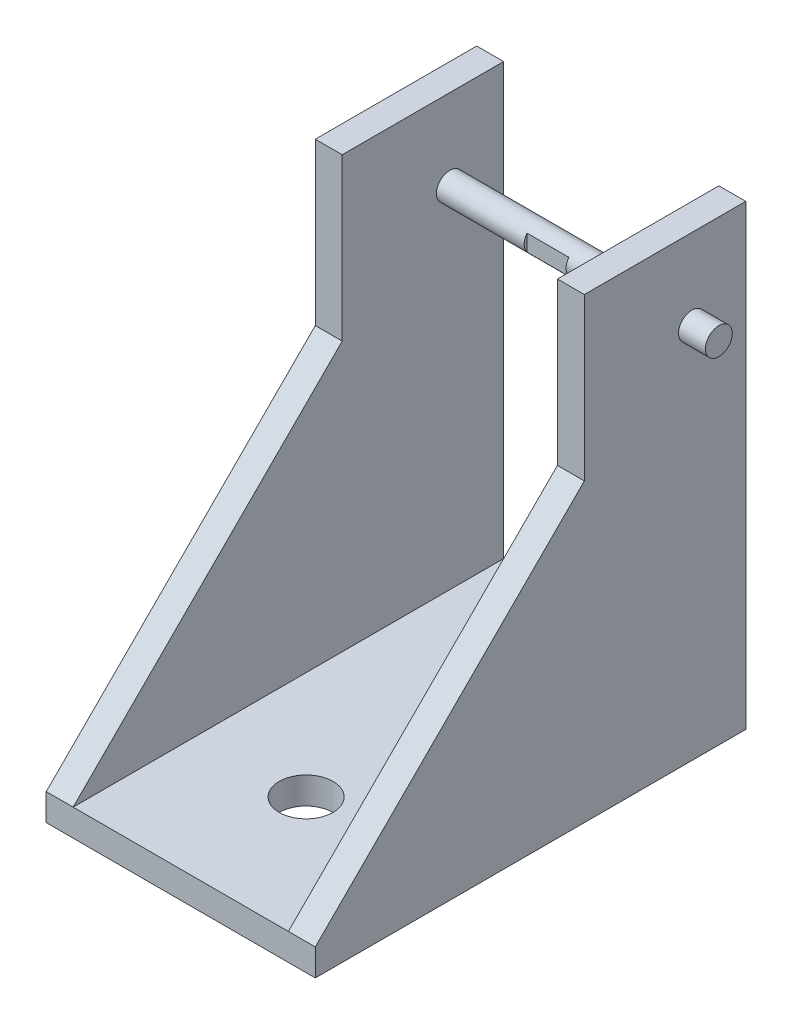
ISO-10303-21;
HEADER;
FILE_DESCRIPTION(('STEP AP214'),'2;1');
FILE_NAME('part.step','',(''),(''),'','','');
FILE_SCHEMA(('AUTOMOTIVE_DESIGN { 1 0 10303 214 1 1 1 1 }'));
ENDSEC;
DATA;
#1=APPLICATION_CONTEXT('core data for automotive mechanical design processes');
#2=APPLICATION_PROTOCOL_DEFINITION('international standard','automotive_design',2000,#1);
#3=PRODUCT_CONTEXT('',#1,'mechanical');
#4=PRODUCT('Part','Part','',(#3));
#5=PRODUCT_RELATED_PRODUCT_CATEGORY('part','',(#4));
#6=PRODUCT_DEFINITION_FORMATION('','',#4);
#7=PRODUCT_DEFINITION_CONTEXT('part definition',#1,'design');
#8=PRODUCT_DEFINITION('design','',#6,#7);
#9=PRODUCT_DEFINITION_SHAPE('','',#8);
#10=(LENGTH_UNIT() NAMED_UNIT(*) SI_UNIT(.MILLI.,.METRE.));
#11=(NAMED_UNIT(*) PLANE_ANGLE_UNIT() SI_UNIT($,.RADIAN.));
#12=(NAMED_UNIT(*) SI_UNIT($,.STERADIAN.) SOLID_ANGLE_UNIT());
#13=UNCERTAINTY_MEASURE_WITH_UNIT(LENGTH_MEASURE(1.E-05),#10,'distance_accuracy_value','');
#14=(GEOMETRIC_REPRESENTATION_CONTEXT(3) GLOBAL_UNCERTAINTY_ASSIGNED_CONTEXT((#13)) GLOBAL_UNIT_ASSIGNED_CONTEXT((#10,
#11,#12)) REPRESENTATION_CONTEXT('',''));
#15=CARTESIAN_POINT('',(0.,0.,0.));
#16=DIRECTION('',(0.,0.,1.));
#17=DIRECTION('',(1.,0.,0.));
#18=AXIS2_PLACEMENT_3D('',#15,#16,#17);
#19=CARTESIAN_POINT('',(0.,6.35,101.6));
#20=DIRECTION('',(0.,-1.,0.));
#21=DIRECTION('',(0.,0.,-1.));
#22=AXIS2_PLACEMENT_3D('',#19,#20,#21);
#23=PLANE('',#22);
#24=CARTESIAN_POINT('',(31.75,6.35,32.1144770075607));
#25=DIRECTION('',(0.,1.,0.));
#26=DIRECTION('',(0.,0.,1.));
#27=AXIS2_PLACEMENT_3D('',#24,#25,#26);
#28=CIRCLE('',#27,6.35);
#29=CARTESIAN_POINT('',(31.75,6.35,38.4644770075607));
#30=VERTEX_POINT('',#29);
#31=EDGE_CURVE('E292',#30,#30,#28,.T.);
#32=ORIENTED_EDGE('',*,*,#31,.F.);
#33=EDGE_LOOP('',(#32));
#34=FACE_BOUND('',#33,.T.);
#35=CARTESIAN_POINT('',(31.75,6.35,72.0235509811005));
#36=DIRECTION('',(0.,1.,0.));
#37=DIRECTION('',(0.,0.,1.));
#38=AXIS2_PLACEMENT_3D('',#35,#36,#37);
#39=CIRCLE('',#38,6.35);
#40=CARTESIAN_POINT('',(31.75,6.35,78.3735509811005));
#41=VERTEX_POINT('',#40);
#42=EDGE_CURVE('E286',#41,#41,#39,.T.);
#43=ORIENTED_EDGE('',*,*,#42,.F.);
#44=EDGE_LOOP('',(#43));
#45=FACE_BOUND('',#44,.T.);
#46=DIRECTION('',(0.,0.,-1.));
#47=VECTOR('',#46,1.);
#48=CARTESIAN_POINT('',(6.35,6.35,0.));
#49=LINE('',#48,#47);
#50=CARTESIAN_POINT('',(6.35,6.35,101.6));
#51=VERTEX_POINT('',#50);
#52=CARTESIAN_POINT('',(6.35,6.35,0.));
#53=VERTEX_POINT('',#52);
#54=EDGE_CURVE('E61',#51,#53,#49,.T.);
#55=ORIENTED_EDGE('',*,*,#54,.F.);
#56=DIRECTION('',(-1.,0.,0.));
#57=VECTOR('',#56,1.);
#58=CARTESIAN_POINT('',(0.,6.35,101.6));
#59=LINE('',#58,#57);
#60=CARTESIAN_POINT('',(57.15,6.35,101.6));
#61=VERTEX_POINT('',#60);
#62=EDGE_CURVE('E196',#61,#51,#59,.T.);
#63=ORIENTED_EDGE('',*,*,#62,.F.);
#64=DIRECTION('',(0.,0.,-1.));
#65=VECTOR('',#64,1.);
#66=CARTESIAN_POINT('',(57.15,6.35,0.));
#67=LINE('',#66,#65);
#68=CARTESIAN_POINT('',(57.15,6.35,0.));
#69=VERTEX_POINT('',#68);
#70=EDGE_CURVE('E156',#61,#69,#67,.T.);
#71=ORIENTED_EDGE('',*,*,#70,.T.);
#72=DIRECTION('',(-1.,0.,0.));
#73=VECTOR('',#72,1.);
#74=CARTESIAN_POINT('',(0.,6.35,0.));
#75=LINE('',#74,#73);
#76=EDGE_CURVE('E191',#69,#53,#75,.T.);
#77=ORIENTED_EDGE('',*,*,#76,.T.);
#78=EDGE_LOOP('',(#55,#63,#71,#77));
#79=FACE_BOUND('',#78,.T.);
#80=ADVANCED_FACE('F39',(#34,#45,#79),#23,.F.);
#81=CARTESIAN_POINT('',(0.,0.,101.6));
#82=DIRECTION('',(1.,0.,0.));
#83=DIRECTION('',(0.,0.,-1.));
#84=AXIS2_PLACEMENT_3D('',#81,#82,#83);
#85=PLANE('',#84);
#86=CARTESIAN_POINT('',(0.,88.9,12.7));
#87=DIRECTION('',(1.,0.,0.));
#88=DIRECTION('',(0.,0.,-1.));
#89=AXIS2_PLACEMENT_3D('',#86,#87,#88);
#90=CIRCLE('',#89,3.175);
#91=CARTESIAN_POINT('',(0.,88.9,9.525));
#92=VERTEX_POINT('',#91);
#93=EDGE_CURVE('E257',#92,#92,#90,.T.);
#94=ORIENTED_EDGE('',*,*,#93,.T.);
#95=EDGE_LOOP('',(#94));
#96=FACE_BOUND('',#95,.T.);
#97=DIRECTION('',(0.,-1.,0.));
#98=VECTOR('',#97,1.);
#99=CARTESIAN_POINT('',(0.,0.,0.));
#100=LINE('',#99,#98);
#101=CARTESIAN_POINT('',(0.,107.95,0.));
#102=VERTEX_POINT('',#101);
#103=CARTESIAN_POINT('',(0.,0.,0.));
#104=VERTEX_POINT('',#103);
#105=EDGE_CURVE('E182',#102,#104,#100,.T.);
#106=ORIENTED_EDGE('',*,*,#105,.T.);
#107=DIRECTION('',(0.,0.,-1.));
#108=VECTOR('',#107,1.);
#109=CARTESIAN_POINT('',(0.,0.,101.6));
#110=LINE('',#109,#108);
#111=CARTESIAN_POINT('',(0.,0.,101.6));
#112=VERTEX_POINT('',#111);
#113=EDGE_CURVE('E138',#112,#104,#110,.T.);
#114=ORIENTED_EDGE('',*,*,#113,.F.);
#115=DIRECTION('',(0.,-1.,0.));
#116=VECTOR('',#115,1.);
#117=CARTESIAN_POINT('',(0.,0.,101.6));
#118=LINE('',#117,#116);
#119=CARTESIAN_POINT('',(0.,6.35,101.6));
#120=VERTEX_POINT('',#119);
#121=EDGE_CURVE('E187',#120,#112,#118,.T.);
#122=ORIENTED_EDGE('',*,*,#121,.F.);
#123=DIRECTION('',(0.,-0.70710678118655,0.707106781186545));
#124=VECTOR('',#123,1.);
#125=CARTESIAN_POINT('',(0.,6.35,101.6));
#126=LINE('',#125,#124);
#127=CARTESIAN_POINT('',(0.,69.8500000000006,38.0999999999998));
#128=VERTEX_POINT('',#127);
#129=EDGE_CURVE('E251',#128,#120,#126,.T.);
#130=ORIENTED_EDGE('',*,*,#129,.F.);
#131=DIRECTION('',(0.,-1.,0.));
#132=VECTOR('',#131,1.);
#133=CARTESIAN_POINT('',(0.,107.95,38.0999999999993));
#134=LINE('',#133,#132);
#135=CARTESIAN_POINT('',(0.,107.95,38.0999999999993));
#136=VERTEX_POINT('',#135);
#137=EDGE_CURVE('E248',#136,#128,#134,.T.);
#138=ORIENTED_EDGE('',*,*,#137,.F.);
#139=DIRECTION('',(0.,0.,1.));
#140=VECTOR('',#139,1.);
#141=CARTESIAN_POINT('',(0.,107.95,0.));
#142=LINE('',#141,#140);
#143=EDGE_CURVE('E254',#102,#136,#142,.T.);
#144=ORIENTED_EDGE('',*,*,#143,.F.);
#145=EDGE_LOOP('',(#106,#114,#122,#130,#138,#144));
#146=FACE_BOUND('',#145,.T.);
#147=ADVANCED_FACE('F41',(#96,#146),#85,.F.);
#148=CARTESIAN_POINT('',(0.,0.,101.6));
#149=DIRECTION('',(0.,1.,0.));
#150=DIRECTION('',(0.,0.,1.));
#151=AXIS2_PLACEMENT_3D('',#148,#149,#150);
#152=PLANE('',#151);
#153=CARTESIAN_POINT('',(31.75,0.,32.1144770075607));
#154=DIRECTION('',(0.,1.,0.));
#155=DIRECTION('',(0.,0.,1.));
#156=AXIS2_PLACEMENT_3D('',#153,#154,#155);
#157=CIRCLE('',#156,6.35);
#158=CARTESIAN_POINT('',(31.75,0.,38.4644770075607));
#159=VERTEX_POINT('',#158);
#160=EDGE_CURVE('E289',#159,#159,#157,.F.);
#161=ORIENTED_EDGE('',*,*,#160,.F.);
#162=EDGE_LOOP('',(#161));
#163=FACE_BOUND('',#162,.T.);
#164=CARTESIAN_POINT('',(31.75,0.,72.0235509811005));
#165=DIRECTION('',(0.,1.,0.));
#166=DIRECTION('',(0.,0.,1.));
#167=AXIS2_PLACEMENT_3D('',#164,#165,#166);
#168=CIRCLE('',#167,6.35);
#169=CARTESIAN_POINT('',(31.75,0.,78.3735509811005));
#170=VERTEX_POINT('',#169);
#171=EDGE_CURVE('E283',#170,#170,#168,.F.);
#172=ORIENTED_EDGE('',*,*,#171,.F.);
#173=EDGE_LOOP('',(#172));
#174=FACE_BOUND('',#173,.T.);
#175=DIRECTION('',(1.,0.,0.));
#176=VECTOR('',#175,1.);
#177=CARTESIAN_POINT('',(0.,0.,0.));
#178=LINE('',#177,#176);
#179=CARTESIAN_POINT('',(63.5,0.,0.));
#180=VERTEX_POINT('',#179);
#181=EDGE_CURVE('E334',#104,#180,#178,.T.);
#182=ORIENTED_EDGE('',*,*,#181,.T.);
#183=DIRECTION('',(0.,0.,-1.));
#184=VECTOR('',#183,1.);
#185=CARTESIAN_POINT('',(63.5,0.,101.6));
#186=LINE('',#185,#184);
#187=CARTESIAN_POINT('',(63.5,0.,101.6));
#188=VERTEX_POINT('',#187);
#189=EDGE_CURVE('E206',#188,#180,#186,.T.);
#190=ORIENTED_EDGE('',*,*,#189,.F.);
#191=DIRECTION('',(1.,0.,0.));
#192=VECTOR('',#191,1.);
#193=CARTESIAN_POINT('',(0.,0.,101.6));
#194=LINE('',#193,#192);
#195=EDGE_CURVE('E190',#112,#188,#194,.T.);
#196=ORIENTED_EDGE('',*,*,#195,.F.);
#197=ORIENTED_EDGE('',*,*,#113,.T.);
#198=EDGE_LOOP('',(#182,#190,#196,#197));
#199=FACE_BOUND('',#198,.T.);
#200=ADVANCED_FACE('F315',(#163,#174,#199),#152,.F.);
#201=CARTESIAN_POINT('',(63.5,0.,101.6));
#202=DIRECTION('',(-1.,0.,0.));
#203=DIRECTION('',(0.,0.,1.));
#204=AXIS2_PLACEMENT_3D('',#201,#202,#203);
#205=PLANE('',#204);
#206=CARTESIAN_POINT('',(63.5,88.9,12.7));
#207=DIRECTION('',(-1.,0.,0.));
#208=DIRECTION('',(0.,0.,1.));
#209=AXIS2_PLACEMENT_3D('',#206,#207,#208);
#210=CIRCLE('',#209,3.175);
#211=CARTESIAN_POINT('',(63.5,88.9,15.875));
#212=VERTEX_POINT('',#211);
#213=EDGE_CURVE('E268',#212,#212,#210,.T.);
#214=ORIENTED_EDGE('',*,*,#213,.T.);
#215=EDGE_LOOP('',(#214));
#216=FACE_BOUND('',#215,.T.);
#217=DIRECTION('',(0.,1.,0.));
#218=VECTOR('',#217,1.);
#219=CARTESIAN_POINT('',(63.5,0.,0.));
#220=LINE('',#219,#218);
#221=CARTESIAN_POINT('',(63.5,107.95,0.));
#222=VERTEX_POINT('',#221);
#223=EDGE_CURVE('E337',#180,#222,#220,.T.);
#224=ORIENTED_EDGE('',*,*,#223,.T.);
#225=DIRECTION('',(0.,0.,1.));
#226=VECTOR('',#225,1.);
#227=CARTESIAN_POINT('',(63.5,107.95,0.));
#228=LINE('',#227,#226);
#229=CARTESIAN_POINT('',(63.5,107.95,38.0999999999993));
#230=VERTEX_POINT('',#229);
#231=EDGE_CURVE('E168',#222,#230,#228,.T.);
#232=ORIENTED_EDGE('',*,*,#231,.T.);
#233=DIRECTION('',(0.,-1.,0.));
#234=VECTOR('',#233,1.);
#235=CARTESIAN_POINT('',(63.5,107.95,38.0999999999993));
#236=LINE('',#235,#234);
#237=CARTESIAN_POINT('',(63.5,69.8500000000006,38.0999999999998));
#238=VERTEX_POINT('',#237);
#239=EDGE_CURVE('E171',#230,#238,#236,.T.);
#240=ORIENTED_EDGE('',*,*,#239,.T.);
#241=DIRECTION('',(0.,-0.70710678118655,0.707106781186545));
#242=VECTOR('',#241,1.);
#243=CARTESIAN_POINT('',(63.5,6.35,101.6));
#244=LINE('',#243,#242);
#245=CARTESIAN_POINT('',(63.5,6.35,101.6));
#246=VERTEX_POINT('',#245);
#247=EDGE_CURVE('E175',#238,#246,#244,.T.);
#248=ORIENTED_EDGE('',*,*,#247,.T.);
#249=DIRECTION('',(0.,1.,0.));
#250=VECTOR('',#249,1.);
#251=CARTESIAN_POINT('',(63.5,0.,101.6));
#252=LINE('',#251,#250);
#253=EDGE_CURVE('E193',#188,#246,#252,.T.);
#254=ORIENTED_EDGE('',*,*,#253,.F.);
#255=ORIENTED_EDGE('',*,*,#189,.T.);
#256=EDGE_LOOP('',(#224,#232,#240,#248,#254,#255));
#257=FACE_BOUND('',#256,.T.);
#258=ADVANCED_FACE('F228',(#216,#257),#205,.F.);
#259=CARTESIAN_POINT('',(0.,6.35,101.6));
#260=DIRECTION('',(0.,0.,-1.));
#261=DIRECTION('',(-1.,0.,0.));
#262=AXIS2_PLACEMENT_3D('',#259,#260,#261);
#263=PLANE('',#262);
#264=ORIENTED_EDGE('',*,*,#121,.T.);
#265=ORIENTED_EDGE('',*,*,#195,.T.);
#266=ORIENTED_EDGE('',*,*,#253,.T.);
#267=EDGE_CURVE('E204',#246,#61,#59,.T.);
#268=ORIENTED_EDGE('',*,*,#267,.T.);
#269=ORIENTED_EDGE('',*,*,#62,.T.);
#270=DIRECTION('',(-1.,0.,0.));
#271=VECTOR('',#270,1.);
#272=CARTESIAN_POINT('',(6.35,6.35,101.6));
#273=LINE('',#272,#271);
#274=EDGE_CURVE('E240',#51,#120,#273,.T.);
#275=ORIENTED_EDGE('',*,*,#274,.T.);
#276=EDGE_LOOP('',(#264,#265,#266,#268,#269,#275));
#277=FACE_BOUND('',#276,.T.);
#278=ADVANCED_FACE('F222',(#277),#263,.F.);
#279=CARTESIAN_POINT('',(0.,6.35,0.));
#280=DIRECTION('',(0.,0.,-1.));
#281=DIRECTION('',(-1.,0.,0.));
#282=AXIS2_PLACEMENT_3D('',#279,#280,#281);
#283=PLANE('',#282);
#284=ORIENTED_EDGE('',*,*,#105,.F.);
#285=DIRECTION('',(-1.,0.,0.));
#286=VECTOR('',#285,1.);
#287=CARTESIAN_POINT('',(6.35,107.95,0.));
#288=LINE('',#287,#286);
#289=CARTESIAN_POINT('',(6.35,107.95,0.));
#290=VERTEX_POINT('',#289);
#291=EDGE_CURVE('E237',#290,#102,#288,.T.);
#292=ORIENTED_EDGE('',*,*,#291,.F.);
#293=DIRECTION('',(0.,1.,0.));
#294=VECTOR('',#293,1.);
#295=CARTESIAN_POINT('',(6.35,107.95,0.));
#296=LINE('',#295,#294);
#297=EDGE_CURVE('E262',#53,#290,#296,.T.);
#298=ORIENTED_EDGE('',*,*,#297,.F.);
#299=ORIENTED_EDGE('',*,*,#76,.F.);
#300=DIRECTION('',(0.,1.,0.));
#301=VECTOR('',#300,1.);
#302=CARTESIAN_POINT('',(57.15,107.95,0.));
#303=LINE('',#302,#301);
#304=CARTESIAN_POINT('',(57.15,107.95,0.));
#305=VERTEX_POINT('',#304);
#306=EDGE_CURVE('E161',#69,#305,#303,.T.);
#307=ORIENTED_EDGE('',*,*,#306,.T.);
#308=DIRECTION('',(1.,0.,0.));
#309=VECTOR('',#308,1.);
#310=CARTESIAN_POINT('',(57.15,107.95,0.));
#311=LINE('',#310,#309);
#312=EDGE_CURVE('E179',#305,#222,#311,.T.);
#313=ORIENTED_EDGE('',*,*,#312,.T.);
#314=ORIENTED_EDGE('',*,*,#223,.F.);
#315=ORIENTED_EDGE('',*,*,#181,.F.);
#316=EDGE_LOOP('',(#284,#292,#298,#299,#307,#313,#314,#315));
#317=FACE_BOUND('',#316,.T.);
#318=ADVANCED_FACE('F210',(#317),#283,.T.);
#319=CARTESIAN_POINT('',(57.15,107.95,0.));
#320=DIRECTION('',(0.,1.,0.));
#321=DIRECTION('',(0.,0.,1.));
#322=AXIS2_PLACEMENT_3D('',#319,#320,#321);
#323=PLANE('',#322);
#324=ORIENTED_EDGE('',*,*,#231,.F.);
#325=ORIENTED_EDGE('',*,*,#312,.F.);
#326=DIRECTION('',(0.,0.,1.));
#327=VECTOR('',#326,1.);
#328=CARTESIAN_POINT('',(57.15,107.95,0.));
#329=LINE('',#328,#327);
#330=CARTESIAN_POINT('',(57.15,107.95,38.0999999999993));
#331=VERTEX_POINT('',#330);
#332=EDGE_CURVE('E178',#305,#331,#329,.T.);
#333=ORIENTED_EDGE('',*,*,#332,.T.);
#334=DIRECTION('',(1.,0.,0.));
#335=VECTOR('',#334,1.);
#336=CARTESIAN_POINT('',(57.15,107.95,38.0999999999993));
#337=LINE('',#336,#335);
#338=EDGE_CURVE('E185',#331,#230,#337,.T.);
#339=ORIENTED_EDGE('',*,*,#338,.T.);
#340=EDGE_LOOP('',(#324,#325,#333,#339));
#341=FACE_BOUND('',#340,.T.);
#342=ADVANCED_FACE('F235',(#341),#323,.T.);
#343=CARTESIAN_POINT('',(57.15,6.35,101.6));
#344=DIRECTION('',(0.,0.707106781186545,0.70710678118655));
#345=DIRECTION('',(0.,-0.70710678118655,0.707106781186545));
#346=AXIS2_PLACEMENT_3D('',#343,#344,#345);
#347=PLANE('',#346);
#348=ORIENTED_EDGE('',*,*,#247,.F.);
#349=DIRECTION('',(1.,0.,0.));
#350=VECTOR('',#349,1.);
#351=CARTESIAN_POINT('',(57.15,69.8500000000006,38.0999999999998));
#352=LINE('',#351,#350);
#353=CARTESIAN_POINT('',(57.15,69.8500000000006,38.0999999999998));
#354=VERTEX_POINT('',#353);
#355=EDGE_CURVE('E183',#354,#238,#352,.T.);
#356=ORIENTED_EDGE('',*,*,#355,.F.);
#357=DIRECTION('',(0.,-0.70710678118655,0.707106781186545));
#358=VECTOR('',#357,1.);
#359=CARTESIAN_POINT('',(57.15,6.35,101.6));
#360=LINE('',#359,#358);
#361=EDGE_CURVE('E153',#354,#61,#360,.T.);
#362=ORIENTED_EDGE('',*,*,#361,.T.);
#363=ORIENTED_EDGE('',*,*,#267,.F.);
#364=EDGE_LOOP('',(#348,#356,#362,#363));
#365=FACE_BOUND('',#364,.T.);
#366=ADVANCED_FACE('F226',(#365),#347,.T.);
#367=CARTESIAN_POINT('',(57.15,107.95,38.0999999999993));
#368=DIRECTION('',(0.,0.,1.));
#369=DIRECTION('',(0.,-1.,0.));
#370=AXIS2_PLACEMENT_3D('',#367,#368,#369);
#371=PLANE('',#370);
#372=ORIENTED_EDGE('',*,*,#239,.F.);
#373=ORIENTED_EDGE('',*,*,#338,.F.);
#374=DIRECTION('',(0.,-1.,0.));
#375=VECTOR('',#374,1.);
#376=CARTESIAN_POINT('',(57.15,107.95,38.0999999999993));
#377=LINE('',#376,#375);
#378=EDGE_CURVE('E157',#331,#354,#377,.T.);
#379=ORIENTED_EDGE('',*,*,#378,.T.);
#380=ORIENTED_EDGE('',*,*,#355,.T.);
#381=EDGE_LOOP('',(#372,#373,#379,#380));
#382=FACE_BOUND('',#381,.T.);
#383=ADVANCED_FACE('F232',(#382),#371,.T.);
#384=CARTESIAN_POINT('',(57.15,107.95,38.0999999999993));
#385=DIRECTION('',(1.,0.,0.));
#386=DIRECTION('',(0.,0.,-1.));
#387=AXIS2_PLACEMENT_3D('',#384,#385,#386);
#388=PLANE('',#387);
#389=CARTESIAN_POINT('',(57.15,88.9,12.7));
#390=DIRECTION('',(1.,0.,0.));
#391=DIRECTION('',(0.,0.,-1.));
#392=AXIS2_PLACEMENT_3D('',#389,#390,#391);
#393=CIRCLE('',#392,3.175);
#394=CARTESIAN_POINT('',(57.15,88.9,9.525));
#395=VERTEX_POINT('',#394);
#396=EDGE_CURVE('E271',#395,#395,#393,.T.);
#397=ORIENTED_EDGE('',*,*,#396,.T.);
#398=EDGE_LOOP('',(#397));
#399=FACE_BOUND('',#398,.T.);
#400=ORIENTED_EDGE('',*,*,#332,.F.);
#401=ORIENTED_EDGE('',*,*,#306,.F.);
#402=ORIENTED_EDGE('',*,*,#70,.F.);
#403=ORIENTED_EDGE('',*,*,#361,.F.);
#404=ORIENTED_EDGE('',*,*,#378,.F.);
#405=EDGE_LOOP('',(#400,#401,#402,#403,#404));
#406=FACE_BOUND('',#405,.T.);
#407=ADVANCED_FACE('F216',(#399,#406),#388,.F.);
#408=CARTESIAN_POINT('',(6.35,107.95,0.));
#409=DIRECTION('',(0.,-1.,0.));
#410=DIRECTION('',(0.,0.,-1.));
#411=AXIS2_PLACEMENT_3D('',#408,#409,#410);
#412=PLANE('',#411);
#413=ORIENTED_EDGE('',*,*,#143,.T.);
#414=DIRECTION('',(-1.,0.,0.));
#415=VECTOR('',#414,1.);
#416=CARTESIAN_POINT('',(6.35,107.95,38.0999999999993));
#417=LINE('',#416,#415);
#418=CARTESIAN_POINT('',(6.35,107.95,38.0999999999993));
#419=VERTEX_POINT('',#418);
#420=EDGE_CURVE('E172',#419,#136,#417,.T.);
#421=ORIENTED_EDGE('',*,*,#420,.F.);
#422=DIRECTION('',(0.,0.,1.));
#423=VECTOR('',#422,1.);
#424=CARTESIAN_POINT('',(6.35,107.95,0.));
#425=LINE('',#424,#423);
#426=EDGE_CURVE('E250',#290,#419,#425,.T.);
#427=ORIENTED_EDGE('',*,*,#426,.F.);
#428=ORIENTED_EDGE('',*,*,#291,.T.);
#429=EDGE_LOOP('',(#413,#421,#427,#428));
#430=FACE_BOUND('',#429,.T.);
#431=ADVANCED_FACE('F349',(#430),#412,.F.);
#432=CARTESIAN_POINT('',(6.35,107.95,38.0999999999993));
#433=DIRECTION('',(0.,0.,-1.));
#434=DIRECTION('',(0.,1.,0.));
#435=AXIS2_PLACEMENT_3D('',#432,#433,#434);
#436=PLANE('',#435);
#437=ORIENTED_EDGE('',*,*,#137,.T.);
#438=DIRECTION('',(-1.,0.,0.));
#439=VECTOR('',#438,1.);
#440=CARTESIAN_POINT('',(6.35,69.8500000000006,38.0999999999998));
#441=LINE('',#440,#439);
#442=CARTESIAN_POINT('',(6.35,69.8500000000006,38.0999999999998));
#443=VERTEX_POINT('',#442);
#444=EDGE_CURVE('E243',#443,#128,#441,.T.);
#445=ORIENTED_EDGE('',*,*,#444,.F.);
#446=DIRECTION('',(0.,-1.,0.));
#447=VECTOR('',#446,1.);
#448=CARTESIAN_POINT('',(6.35,107.95,38.0999999999993));
#449=LINE('',#448,#447);
#450=EDGE_CURVE('E241',#419,#443,#449,.T.);
#451=ORIENTED_EDGE('',*,*,#450,.F.);
#452=ORIENTED_EDGE('',*,*,#420,.T.);
#453=EDGE_LOOP('',(#437,#445,#451,#452));
#454=FACE_BOUND('',#453,.T.);
#455=ADVANCED_FACE('F360',(#454),#436,.F.);
#456=CARTESIAN_POINT('',(6.35,6.35,101.6));
#457=DIRECTION('',(0.,-0.707106781186545,-0.70710678118655));
#458=DIRECTION('',(0.,0.70710678118655,-0.707106781186545));
#459=AXIS2_PLACEMENT_3D('',#456,#457,#458);
#460=PLANE('',#459);
#461=ORIENTED_EDGE('',*,*,#129,.T.);
#462=ORIENTED_EDGE('',*,*,#274,.F.);
#463=DIRECTION('',(0.,-0.70710678118655,0.707106781186545));
#464=VECTOR('',#463,1.);
#465=CARTESIAN_POINT('',(6.35,6.35,101.6));
#466=LINE('',#465,#464);
#467=EDGE_CURVE('E259',#443,#51,#466,.T.);
#468=ORIENTED_EDGE('',*,*,#467,.F.);
#469=ORIENTED_EDGE('',*,*,#444,.T.);
#470=EDGE_LOOP('',(#461,#462,#468,#469));
#471=FACE_BOUND('',#470,.T.);
#472=ADVANCED_FACE('F357',(#471),#460,.F.);
#473=CARTESIAN_POINT('',(6.35,107.95,38.0999999999993));
#474=DIRECTION('',(-1.,0.,0.));
#475=DIRECTION('',(0.,0.,-1.));
#476=AXIS2_PLACEMENT_3D('',#473,#474,#475);
#477=PLANE('',#476);
#478=CARTESIAN_POINT('',(6.34999999999999,88.9,12.7));
#479=DIRECTION('',(-1.,0.,0.));
#480=DIRECTION('',(0.,0.,1.));
#481=AXIS2_PLACEMENT_3D('',#478,#479,#480);
#482=CIRCLE('',#481,3.175);
#483=CARTESIAN_POINT('',(6.34999999999999,88.9,15.875));
#484=VERTEX_POINT('',#483);
#485=EDGE_CURVE('E274',#484,#484,#482,.T.);
#486=ORIENTED_EDGE('',*,*,#485,.T.);
#487=EDGE_LOOP('',(#486));
#488=FACE_BOUND('',#487,.T.);
#489=ORIENTED_EDGE('',*,*,#426,.T.);
#490=ORIENTED_EDGE('',*,*,#450,.T.);
#491=ORIENTED_EDGE('',*,*,#467,.T.);
#492=ORIENTED_EDGE('',*,*,#54,.T.);
#493=ORIENTED_EDGE('',*,*,#297,.T.);
#494=EDGE_LOOP('',(#489,#490,#491,#492,#493));
#495=FACE_BOUND('',#494,.T.);
#496=ADVANCED_FACE('F352',(#488,#495),#477,.F.);
#497=CARTESIAN_POINT('',(69.85,88.9,12.7));
#498=DIRECTION('',(-1.,0.,0.));
#499=DIRECTION('',(0.,0.,1.));
#500=AXIS2_PLACEMENT_3D('',#497,#498,#499);
#501=CYLINDRICAL_SURFACE('',#500,3.175);
#502=CARTESIAN_POINT('',(27.0782513068394,88.9,12.7));
#503=DIRECTION('',(-1.,0.,0.));
#504=DIRECTION('',(0.,0.,1.));
#505=AXIS2_PLACEMENT_3D('',#502,#503,#504);
#506=CIRCLE('',#505,3.175);
#507=CARTESIAN_POINT('',(27.0782513068394,90.8436202151298,15.2105707437431));
#508=VERTEX_POINT('',#507);
#509=CARTESIAN_POINT('',(27.0782513068394,86.9563797848702,15.2105707437431));
#510=VERTEX_POINT('',#509);
#511=EDGE_CURVE('E11',#508,#510,#506,.F.);
#512=ORIENTED_EDGE('',*,*,#511,.F.);
#513=DIRECTION('',(-1.,0.,0.));
#514=VECTOR('',#513,1.);
#515=CARTESIAN_POINT('',(69.85,90.8436202151298,15.2105707437431));
#516=LINE('',#515,#514);
#517=CARTESIAN_POINT('',(36.961555121422,90.8436202151298,15.2105707437431));
#518=VERTEX_POINT('',#517);
#519=EDGE_CURVE('E137',#518,#508,#516,.T.);
#520=ORIENTED_EDGE('',*,*,#519,.F.);
#521=CARTESIAN_POINT('',(36.961555121422,88.9,12.7));
#522=DIRECTION('',(1.,0.,0.));
#523=DIRECTION('',(0.,0.,-1.));
#524=AXIS2_PLACEMENT_3D('',#521,#522,#523);
#525=CIRCLE('',#524,3.175);
#526=CARTESIAN_POINT('',(36.961555121422,86.9563797848702,15.2105707437431));
#527=VERTEX_POINT('',#526);
#528=EDGE_CURVE('E132',#527,#518,#525,.F.);
#529=ORIENTED_EDGE('',*,*,#528,.F.);
#530=DIRECTION('',(-1.,0.,0.));
#531=VECTOR('',#530,1.);
#532=CARTESIAN_POINT('',(69.85,86.9563797848702,15.2105707437431));
#533=LINE('',#532,#531);
#534=EDGE_CURVE('E47',#510,#527,#533,.F.);
#535=ORIENTED_EDGE('',*,*,#534,.F.);
#536=EDGE_LOOP('',(#512,#520,#529,#535));
#537=FACE_BOUND('',#536,.T.);
#538=ORIENTED_EDGE('',*,*,#485,.F.);
#539=EDGE_LOOP('',(#538));
#540=FACE_BOUND('',#539,.T.);
#541=ORIENTED_EDGE('',*,*,#396,.F.);
#542=EDGE_LOOP('',(#541));
#543=FACE_BOUND('',#542,.T.);
#544=ADVANCED_FACE('F147',(#537,#540,#543),#501,.T.);
#545=CARTESIAN_POINT('',(69.85,88.9,12.7));
#546=DIRECTION('',(-1.,0.,0.));
#547=DIRECTION('',(0.,0.,1.));
#548=AXIS2_PLACEMENT_3D('',#545,#546,#547);
#549=PLANE('',#548);
#550=CARTESIAN_POINT('',(69.85,88.9,12.7));
#551=DIRECTION('',(-1.,0.,0.));
#552=DIRECTION('',(0.,0.,1.));
#553=AXIS2_PLACEMENT_3D('',#550,#551,#552);
#554=CIRCLE('',#553,3.175);
#555=CARTESIAN_POINT('',(69.85,88.9,15.875));
#556=VERTEX_POINT('',#555);
#557=EDGE_CURVE('E277',#556,#556,#554,.T.);
#558=ORIENTED_EDGE('',*,*,#557,.F.);
#559=EDGE_LOOP('',(#558));
#560=FACE_BOUND('',#559,.T.);
#561=ADVANCED_FACE('F490',(#560),#549,.F.);
#562=ORIENTED_EDGE('',*,*,#557,.T.);
#563=EDGE_LOOP('',(#562));
#564=FACE_BOUND('',#563,.T.);
#565=ORIENTED_EDGE('',*,*,#213,.F.);
#566=EDGE_LOOP('',(#565));
#567=FACE_BOUND('',#566,.T.);
#568=ADVANCED_FACE('F492',(#564,#567),#501,.T.);
#569=CARTESIAN_POINT('',(-6.35,88.9,12.7));
#570=DIRECTION('',(-1.,0.,0.));
#571=DIRECTION('',(0.,0.,1.));
#572=AXIS2_PLACEMENT_3D('',#569,#570,#571);
#573=CIRCLE('',#572,3.175);
#574=CARTESIAN_POINT('',(-6.35,88.9,15.875));
#575=VERTEX_POINT('',#574);
#576=EDGE_CURVE('E280',#575,#575,#573,.T.);
#577=ORIENTED_EDGE('',*,*,#576,.F.);
#578=EDGE_LOOP('',(#577));
#579=FACE_BOUND('',#578,.T.);
#580=ORIENTED_EDGE('',*,*,#93,.F.);
#581=EDGE_LOOP('',(#580));
#582=FACE_BOUND('',#581,.T.);
#583=ADVANCED_FACE('F491',(#579,#582),#501,.T.);
#584=CARTESIAN_POINT('',(-6.35,88.9,12.7));
#585=DIRECTION('',(-1.,0.,0.));
#586=DIRECTION('',(0.,0.,1.));
#587=AXIS2_PLACEMENT_3D('',#584,#585,#586);
#588=PLANE('',#587);
#589=ORIENTED_EDGE('',*,*,#576,.T.);
#590=EDGE_LOOP('',(#589));
#591=FACE_BOUND('',#590,.T.);
#592=ADVANCED_FACE('F462',(#591),#588,.T.);
#593=CARTESIAN_POINT('',(31.75,-0.00100000000000013,72.0235509811005));
#594=DIRECTION('',(0.,1.,0.));
#595=DIRECTION('',(0.,0.,1.));
#596=AXIS2_PLACEMENT_3D('',#593,#594,#595);
#597=CYLINDRICAL_SURFACE('',#596,6.35);
#598=ORIENTED_EDGE('',*,*,#42,.T.);
#599=EDGE_LOOP('',(#598));
#600=FACE_BOUND('',#599,.T.);
#601=ORIENTED_EDGE('',*,*,#171,.T.);
#602=EDGE_LOOP('',(#601));
#603=FACE_BOUND('',#602,.T.);
#604=ADVANCED_FACE('F305',(#600,#603),#597,.F.);
#605=CARTESIAN_POINT('',(31.75,-0.00100000000000013,32.1144770075607));
#606=DIRECTION('',(0.,1.,0.));
#607=DIRECTION('',(0.,0.,1.));
#608=AXIS2_PLACEMENT_3D('',#605,#606,#607);
#609=CYLINDRICAL_SURFACE('',#608,6.35);
#610=ORIENTED_EDGE('',*,*,#31,.T.);
#611=EDGE_LOOP('',(#610));
#612=FACE_BOUND('',#611,.T.);
#613=ORIENTED_EDGE('',*,*,#160,.T.);
#614=EDGE_LOOP('',(#613));
#615=FACE_BOUND('',#614,.T.);
#616=ADVANCED_FACE('F298',(#612,#615),#609,.F.);
#617=CARTESIAN_POINT('',(27.0782513068394,82.55,15.2105707437431));
#618=DIRECTION('',(-1.,0.,0.));
#619=DIRECTION('',(0.,0.,1.));
#620=AXIS2_PLACEMENT_3D('',#617,#618,#619);
#621=PLANE('',#620);
#622=ORIENTED_EDGE('',*,*,#511,.T.);
#623=DIRECTION('',(0.,1.,0.));
#624=VECTOR('',#623,1.);
#625=CARTESIAN_POINT('',(27.0782513068394,82.55,15.2105707437431));
#626=LINE('',#625,#624);
#627=EDGE_CURVE('E144',#510,#508,#626,.T.);
#628=ORIENTED_EDGE('',*,*,#627,.T.);
#629=EDGE_LOOP('',(#622,#628));
#630=FACE_BOUND('',#629,.T.);
#631=ADVANCED_FACE('F296',(#630),#621,.F.);
#632=CARTESIAN_POINT('',(27.0782513068394,82.55,15.2105707437431));
#633=DIRECTION('',(0.,0.,-1.));
#634=DIRECTION('',(-1.,0.,0.));
#635=AXIS2_PLACEMENT_3D('',#632,#633,#634);
#636=PLANE('',#635);
#637=ORIENTED_EDGE('',*,*,#534,.T.);
#638=DIRECTION('',(0.,1.,0.));
#639=VECTOR('',#638,1.);
#640=CARTESIAN_POINT('',(36.961555121422,82.55,15.2105707437431));
#641=LINE('',#640,#639);
#642=EDGE_CURVE('E53',#527,#518,#641,.T.);
#643=ORIENTED_EDGE('',*,*,#642,.T.);
#644=ORIENTED_EDGE('',*,*,#519,.T.);
#645=ORIENTED_EDGE('',*,*,#627,.F.);
#646=EDGE_LOOP('',(#637,#643,#644,#645));
#647=FACE_BOUND('',#646,.T.);
#648=ADVANCED_FACE('F141',(#647),#636,.F.);
#649=CARTESIAN_POINT('',(36.961555121422,82.55,15.2105707437431));
#650=DIRECTION('',(1.,0.,0.));
#651=DIRECTION('',(0.,0.,-1.));
#652=AXIS2_PLACEMENT_3D('',#649,#650,#651);
#653=PLANE('',#652);
#654=ORIENTED_EDGE('',*,*,#528,.T.);
#655=ORIENTED_EDGE('',*,*,#642,.F.);
#656=EDGE_LOOP('',(#654,#655));
#657=FACE_BOUND('',#656,.T.);
#658=ADVANCED_FACE('F133',(#657),#653,.F.);
#659=CLOSED_SHELL('',(#80,#147,#200,#258,#278,#318,#342,#366,#383,#407,#431,#455,#472,#496,#544,
#561,#568,#583,#592,#604,#616,#631,#648,#658));
#660=MANIFOLD_SOLID_BREP('B2',#659);
#661=ADVANCED_BREP_SHAPE_REPRESENTATION('',(#18,#660),#14);
#662=SHAPE_DEFINITION_REPRESENTATION(#9,#661);
ENDSEC;
END-ISO-10303-21;
